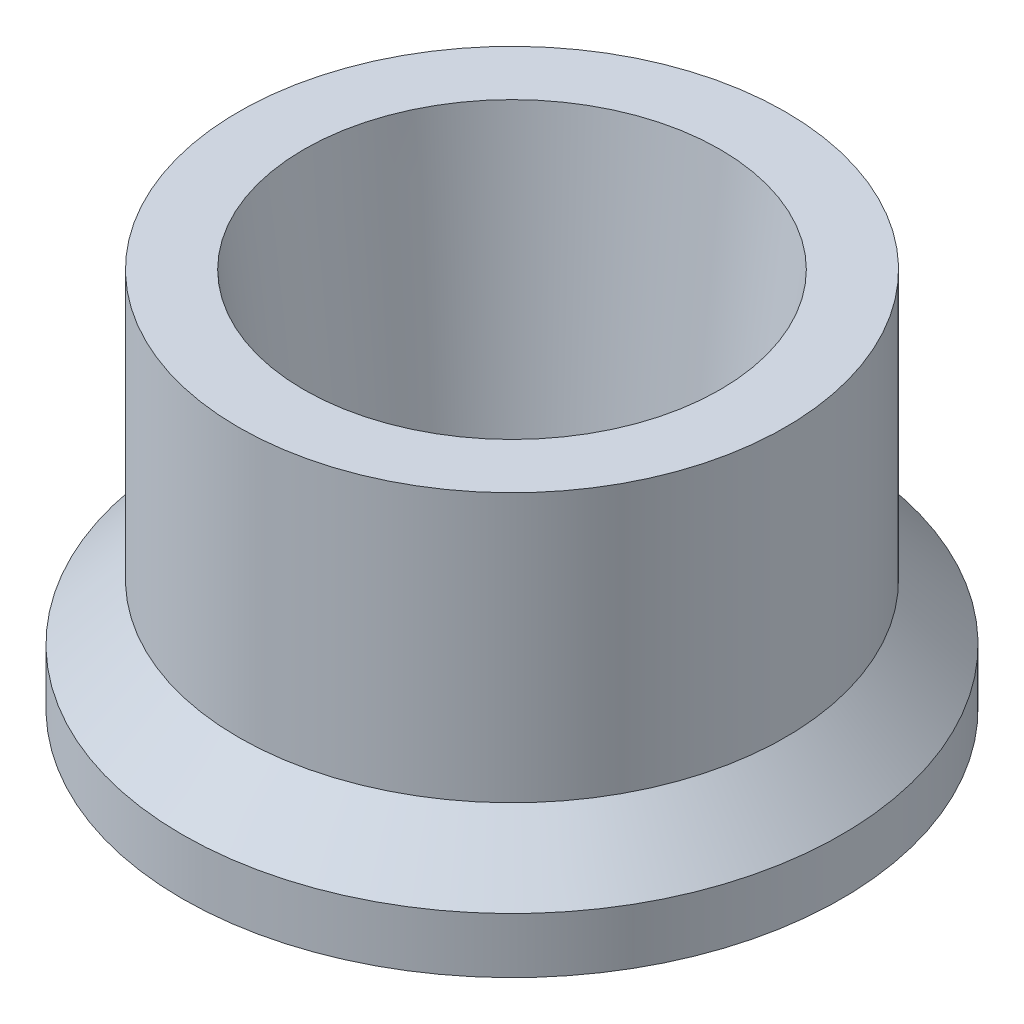
ISO-10303-21;
HEADER;
FILE_DESCRIPTION(('STEP AP214'),'2;1');
FILE_NAME('part.step','',(''),(''),'','','');
FILE_SCHEMA(('AUTOMOTIVE_DESIGN { 1 0 10303 214 1 1 1 1 }'));
ENDSEC;
DATA;
#1=APPLICATION_CONTEXT('core data for automotive mechanical design processes');
#2=APPLICATION_PROTOCOL_DEFINITION('international standard','automotive_design',2000,#1);
#3=PRODUCT_CONTEXT('',#1,'mechanical');
#4=PRODUCT('Part','Part','',(#3));
#5=PRODUCT_RELATED_PRODUCT_CATEGORY('part','',(#4));
#6=PRODUCT_DEFINITION_FORMATION('','',#4);
#7=PRODUCT_DEFINITION_CONTEXT('part definition',#1,'design');
#8=PRODUCT_DEFINITION('design','',#6,#7);
#9=PRODUCT_DEFINITION_SHAPE('','',#8);
#10=(LENGTH_UNIT() NAMED_UNIT(*) SI_UNIT(.MILLI.,.METRE.));
#11=(NAMED_UNIT(*) PLANE_ANGLE_UNIT() SI_UNIT($,.RADIAN.));
#12=(NAMED_UNIT(*) SI_UNIT($,.STERADIAN.) SOLID_ANGLE_UNIT());
#13=UNCERTAINTY_MEASURE_WITH_UNIT(LENGTH_MEASURE(1.E-05),#10,'distance_accuracy_value','');
#14=(GEOMETRIC_REPRESENTATION_CONTEXT(3) GLOBAL_UNCERTAINTY_ASSIGNED_CONTEXT((#13)) GLOBAL_UNIT_ASSIGNED_CONTEXT((#10,
#11,#12)) REPRESENTATION_CONTEXT('',''));
#15=CARTESIAN_POINT('',(0.,0.,0.));
#16=DIRECTION('',(0.,0.,1.));
#17=DIRECTION('',(1.,0.,0.));
#18=AXIS2_PLACEMENT_3D('',#15,#16,#17);
#19=CARTESIAN_POINT('',(6.0325,0.,0.));
#20=DIRECTION('',(0.,-1.,0.));
#21=DIRECTION('',(0.,0.,-1.));
#22=AXIS2_PLACEMENT_3D('',#19,#20,#21);
#23=PLANE('',#22);
#24=CARTESIAN_POINT('',(0.,0.,0.));
#25=DIRECTION('',(0.,-1.,0.));
#26=DIRECTION('',(0.,0.,-1.));
#27=AXIS2_PLACEMENT_3D('',#24,#25,#26);
#28=CIRCLE('',#27,6.0325);
#29=CARTESIAN_POINT('',(0.,0.,-6.0325));
#30=VERTEX_POINT('',#29);
#31=EDGE_CURVE('E10',#30,#30,#28,.T.);
#32=ORIENTED_EDGE('',*,*,#31,.T.);
#33=EDGE_LOOP('',(#32));
#34=FACE_BOUND('',#33,.T.);
#35=CARTESIAN_POINT('',(0.,0.,0.));
#36=DIRECTION('',(0.,-1.,0.));
#37=DIRECTION('',(0.,0.,-1.));
#38=AXIS2_PLACEMENT_3D('',#35,#36,#37);
#39=CIRCLE('',#38,3.048);
#40=CARTESIAN_POINT('',(0.,0.,-3.048));
#41=VERTEX_POINT('',#40);
#42=EDGE_CURVE('E57',#41,#41,#39,.T.);
#43=ORIENTED_EDGE('',*,*,#42,.F.);
#44=EDGE_LOOP('',(#43));
#45=FACE_BOUND('',#44,.T.);
#46=ADVANCED_FACE('F35',(#34,#45),#23,.T.);
#47=CARTESIAN_POINT('',(0.,0.,0.));
#48=DIRECTION('',(0.,-1.,0.));
#49=DIRECTION('',(0.,0.,-1.));
#50=AXIS2_PLACEMENT_3D('',#47,#48,#49);
#51=CYLINDRICAL_SURFACE('',#50,6.0325);
#52=CARTESIAN_POINT('',(0.,1.016,0.));
#53=DIRECTION('',(0.,-1.,0.));
#54=DIRECTION('',(0.,0.,-1.));
#55=AXIS2_PLACEMENT_3D('',#52,#53,#54);
#56=CIRCLE('',#55,6.0325);
#57=CARTESIAN_POINT('',(0.,1.016,-6.0325));
#58=VERTEX_POINT('',#57);
#59=EDGE_CURVE('E41',#58,#58,#56,.T.);
#60=ORIENTED_EDGE('',*,*,#59,.T.);
#61=EDGE_LOOP('',(#60));
#62=FACE_BOUND('',#61,.T.);
#63=ORIENTED_EDGE('',*,*,#31,.F.);
#64=EDGE_LOOP('',(#63));
#65=FACE_BOUND('',#64,.T.);
#66=ADVANCED_FACE('F65',(#62,#65),#51,.T.);
#67=CARTESIAN_POINT('',(0.,1.016,0.));
#68=DIRECTION('',(0.,-1.,0.));
#69=DIRECTION('',(0.,0.,-1.));
#70=AXIS2_PLACEMENT_3D('',#67,#68,#69);
#71=CONICAL_SURFACE('',#70,6.0325,0.78539816339745);
#72=CARTESIAN_POINT('',(0.,2.0447,0.));
#73=DIRECTION('',(0.,-1.,0.));
#74=DIRECTION('',(0.,0.,-1.));
#75=AXIS2_PLACEMENT_3D('',#72,#73,#74);
#76=CIRCLE('',#75,5.0038);
#77=CARTESIAN_POINT('',(0.,2.0447,-5.0038));
#78=VERTEX_POINT('',#77);
#79=EDGE_CURVE('E45',#78,#78,#76,.T.);
#80=ORIENTED_EDGE('',*,*,#79,.T.);
#81=EDGE_LOOP('',(#80));
#82=FACE_BOUND('',#81,.T.);
#83=ORIENTED_EDGE('',*,*,#59,.F.);
#84=EDGE_LOOP('',(#83));
#85=FACE_BOUND('',#84,.T.);
#86=ADVANCED_FACE('F69',(#82,#85),#71,.T.);
#87=CARTESIAN_POINT('',(0.,0.,0.));
#88=DIRECTION('',(0.,-1.,0.));
#89=DIRECTION('',(0.,0.,-1.));
#90=AXIS2_PLACEMENT_3D('',#87,#88,#89);
#91=CYLINDRICAL_SURFACE('',#90,5.0038);
#92=CARTESIAN_POINT('',(0.,6.9596,0.));
#93=DIRECTION('',(0.,-1.,0.));
#94=DIRECTION('',(0.,0.,-1.));
#95=AXIS2_PLACEMENT_3D('',#92,#93,#94);
#96=CIRCLE('',#95,5.0038);
#97=CARTESIAN_POINT('',(0.,6.9596,-5.0038));
#98=VERTEX_POINT('',#97);
#99=EDGE_CURVE('E49',#98,#98,#96,.T.);
#100=ORIENTED_EDGE('',*,*,#99,.T.);
#101=EDGE_LOOP('',(#100));
#102=FACE_BOUND('',#101,.T.);
#103=ORIENTED_EDGE('',*,*,#79,.F.);
#104=EDGE_LOOP('',(#103));
#105=FACE_BOUND('',#104,.T.);
#106=ADVANCED_FACE('F73',(#102,#105),#91,.T.);
#107=CARTESIAN_POINT('',(3.81,6.9596,0.));
#108=DIRECTION('',(0.,1.,0.));
#109=DIRECTION('',(0.,0.,1.));
#110=AXIS2_PLACEMENT_3D('',#107,#108,#109);
#111=PLANE('',#110);
#112=CARTESIAN_POINT('',(0.,6.9596,0.));
#113=DIRECTION('',(0.,-1.,0.));
#114=DIRECTION('',(0.,0.,-1.));
#115=AXIS2_PLACEMENT_3D('',#112,#113,#114);
#116=CIRCLE('',#115,3.81);
#117=CARTESIAN_POINT('',(0.,6.9596,-3.81));
#118=VERTEX_POINT('',#117);
#119=EDGE_CURVE('E54',#118,#118,#116,.T.);
#120=ORIENTED_EDGE('',*,*,#119,.T.);
#121=EDGE_LOOP('',(#120));
#122=FACE_BOUND('',#121,.T.);
#123=ORIENTED_EDGE('',*,*,#99,.F.);
#124=EDGE_LOOP('',(#123));
#125=FACE_BOUND('',#124,.T.);
#126=ADVANCED_FACE('F80',(#122,#125),#111,.T.);
#127=CARTESIAN_POINT('',(0.,6.9596,0.));
#128=DIRECTION('',(0.,1.,0.));
#129=DIRECTION('',(0.,0.,1.));
#130=AXIS2_PLACEMENT_3D('',#127,#128,#129);
#131=CONICAL_SURFACE('',#130,3.81,0.109054658443237);
#132=ORIENTED_EDGE('',*,*,#42,.T.);
#133=EDGE_LOOP('',(#132));
#134=FACE_BOUND('',#133,.T.);
#135=ORIENTED_EDGE('',*,*,#119,.F.);
#136=EDGE_LOOP('',(#135));
#137=FACE_BOUND('',#136,.T.);
#138=ADVANCED_FACE('F61',(#134,#137),#131,.F.);
#139=CLOSED_SHELL('',(#46,#66,#86,#106,#126,#138));
#140=MANIFOLD_SOLID_BREP('B2',#139);
#141=ADVANCED_BREP_SHAPE_REPRESENTATION('',(#18,#140),#14);
#142=SHAPE_DEFINITION_REPRESENTATION(#9,#141);
ENDSEC;
END-ISO-10303-21;
